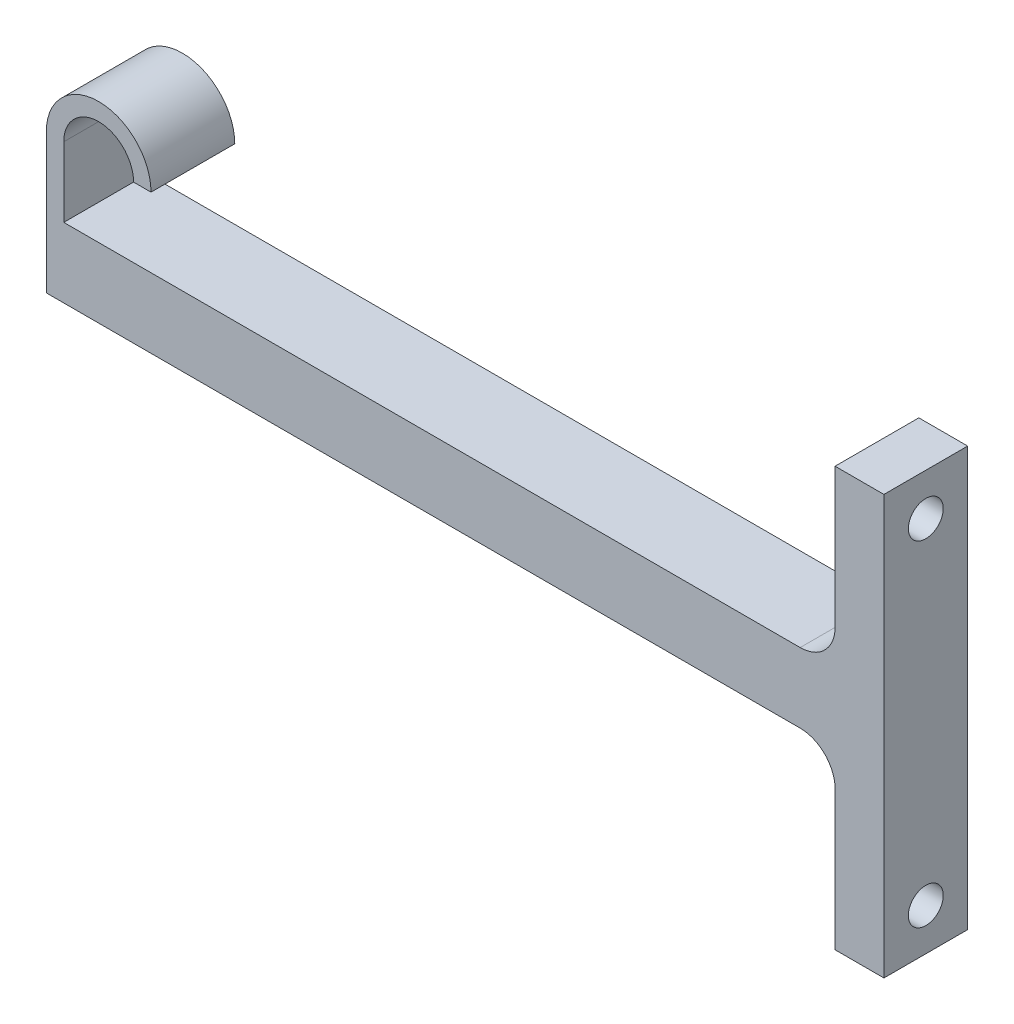
ISO-10303-21;
HEADER;
FILE_DESCRIPTION(('STEP AP214'),'2;1');
FILE_NAME('part.step','',(''),(''),'','','');
FILE_SCHEMA(('AUTOMOTIVE_DESIGN { 1 0 10303 214 1 1 1 1 }'));
ENDSEC;
DATA;
#1=APPLICATION_CONTEXT('core data for automotive mechanical design processes');
#2=APPLICATION_PROTOCOL_DEFINITION('international standard','automotive_design',2000,#1);
#3=PRODUCT_CONTEXT('',#1,'mechanical');
#4=PRODUCT('Part','Part','',(#3));
#5=PRODUCT_RELATED_PRODUCT_CATEGORY('part','',(#4));
#6=PRODUCT_DEFINITION_FORMATION('','',#4);
#7=PRODUCT_DEFINITION_CONTEXT('part definition',#1,'design');
#8=PRODUCT_DEFINITION('design','',#6,#7);
#9=PRODUCT_DEFINITION_SHAPE('','',#8);
#10=(LENGTH_UNIT() NAMED_UNIT(*) SI_UNIT(.MILLI.,.METRE.));
#11=(NAMED_UNIT(*) PLANE_ANGLE_UNIT() SI_UNIT($,.RADIAN.));
#12=(NAMED_UNIT(*) SI_UNIT($,.STERADIAN.) SOLID_ANGLE_UNIT());
#13=UNCERTAINTY_MEASURE_WITH_UNIT(LENGTH_MEASURE(1.E-05),#10,'distance_accuracy_value','');
#14=(GEOMETRIC_REPRESENTATION_CONTEXT(3) GLOBAL_UNCERTAINTY_ASSIGNED_CONTEXT((#13)) GLOBAL_UNIT_ASSIGNED_CONTEXT((#10,
#11,#12)) REPRESENTATION_CONTEXT('',''));
#15=CARTESIAN_POINT('',(0.,0.,0.));
#16=DIRECTION('',(0.,0.,1.));
#17=DIRECTION('',(1.,0.,0.));
#18=AXIS2_PLACEMENT_3D('',#15,#16,#17);
#19=CARTESIAN_POINT('',(7.5,20.,12.));
#20=DIRECTION('',(0.,0.,-1.));
#21=DIRECTION('',(-1.,0.,0.));
#22=AXIS2_PLACEMENT_3D('',#19,#20,#21);
#23=CYLINDRICAL_SURFACE('',#22,7.5);
#24=CARTESIAN_POINT('',(7.5,20.,0.));
#25=DIRECTION('',(0.,0.,1.));
#26=DIRECTION('',(1.,0.,0.));
#27=AXIS2_PLACEMENT_3D('',#24,#25,#26);
#28=CIRCLE('',#27,7.5);
#29=CARTESIAN_POINT('',(15.,20.,0.));
#30=VERTEX_POINT('',#29);
#31=CARTESIAN_POINT('',(0.,20.,0.));
#32=VERTEX_POINT('',#31);
#33=EDGE_CURVE('E166',#30,#32,#28,.T.);
#34=ORIENTED_EDGE('',*,*,#33,.T.);
#35=DIRECTION('',(0.,0.,-1.));
#36=VECTOR('',#35,1.);
#37=CARTESIAN_POINT('',(0.,20.,12.));
#38=LINE('',#37,#36);
#39=CARTESIAN_POINT('',(0.,20.,12.));
#40=VERTEX_POINT('',#39);
#41=EDGE_CURVE('E225',#40,#32,#38,.T.);
#42=ORIENTED_EDGE('',*,*,#41,.F.);
#43=CARTESIAN_POINT('',(7.5,20.,12.));
#44=DIRECTION('',(0.,0.,1.));
#45=DIRECTION('',(1.,0.,0.));
#46=AXIS2_PLACEMENT_3D('',#43,#44,#45);
#47=CIRCLE('',#46,7.5);
#48=CARTESIAN_POINT('',(15.,20.,12.));
#49=VERTEX_POINT('',#48);
#50=EDGE_CURVE('E194',#49,#40,#47,.T.);
#51=ORIENTED_EDGE('',*,*,#50,.F.);
#52=DIRECTION('',(0.,0.,-1.));
#53=VECTOR('',#52,1.);
#54=CARTESIAN_POINT('',(15.,20.,12.));
#55=LINE('',#54,#53);
#56=EDGE_CURVE('E162',#49,#30,#55,.T.);
#57=ORIENTED_EDGE('',*,*,#56,.T.);
#58=EDGE_LOOP('',(#34,#42,#51,#57));
#59=FACE_BOUND('',#58,.T.);
#60=ADVANCED_FACE('F32',(#59),#23,.T.);
#61=CARTESIAN_POINT('',(0.,0.,12.));
#62=DIRECTION('',(1.,0.,0.));
#63=DIRECTION('',(0.,0.,-1.));
#64=AXIS2_PLACEMENT_3D('',#61,#62,#63);
#65=PLANE('',#64);
#66=DIRECTION('',(0.,-1.,0.));
#67=VECTOR('',#66,1.);
#68=CARTESIAN_POINT('',(0.,0.,0.));
#69=LINE('',#68,#67);
#70=CARTESIAN_POINT('',(0.,0.,0.));
#71=VERTEX_POINT('',#70);
#72=EDGE_CURVE('E169',#32,#71,#69,.T.);
#73=ORIENTED_EDGE('',*,*,#72,.T.);
#74=DIRECTION('',(0.,0.,-1.));
#75=VECTOR('',#74,1.);
#76=CARTESIAN_POINT('',(0.,0.,12.));
#77=LINE('',#76,#75);
#78=CARTESIAN_POINT('',(0.,0.,12.));
#79=VERTEX_POINT('',#78);
#80=EDGE_CURVE('E222',#79,#71,#77,.T.);
#81=ORIENTED_EDGE('',*,*,#80,.F.);
#82=DIRECTION('',(0.,-1.,0.));
#83=VECTOR('',#82,1.);
#84=CARTESIAN_POINT('',(0.,0.,12.));
#85=LINE('',#84,#83);
#86=EDGE_CURVE('E111',#40,#79,#85,.T.);
#87=ORIENTED_EDGE('',*,*,#86,.F.);
#88=ORIENTED_EDGE('',*,*,#41,.T.);
#89=EDGE_LOOP('',(#73,#81,#87,#88));
#90=FACE_BOUND('',#89,.T.);
#91=ADVANCED_FACE('F248',(#90),#65,.F.);
#92=CARTESIAN_POINT('',(0.,0.,12.));
#93=DIRECTION('',(0.,1.,0.));
#94=DIRECTION('',(0.,0.,1.));
#95=AXIS2_PLACEMENT_3D('',#92,#93,#94);
#96=PLANE('',#95);
#97=DIRECTION('',(1.,0.,0.));
#98=VECTOR('',#97,1.);
#99=CARTESIAN_POINT('',(0.,0.,0.));
#100=LINE('',#99,#98);
#101=CARTESIAN_POINT('',(108.,0.,0.));
#102=VERTEX_POINT('',#101);
#103=EDGE_CURVE('E172',#71,#102,#100,.T.);
#104=ORIENTED_EDGE('',*,*,#103,.T.);
#105=DIRECTION('',(0.,0.,-1.));
#106=VECTOR('',#105,1.);
#107=CARTESIAN_POINT('',(108.,0.,12.));
#108=LINE('',#107,#106);
#109=CARTESIAN_POINT('',(108.,0.,12.));
#110=VERTEX_POINT('',#109);
#111=EDGE_CURVE('E219',#110,#102,#108,.T.);
#112=ORIENTED_EDGE('',*,*,#111,.F.);
#113=DIRECTION('',(1.,0.,0.));
#114=VECTOR('',#113,1.);
#115=CARTESIAN_POINT('',(0.,0.,12.));
#116=LINE('',#115,#114);
#117=EDGE_CURVE('E322',#79,#110,#116,.T.);
#118=ORIENTED_EDGE('',*,*,#117,.F.);
#119=ORIENTED_EDGE('',*,*,#80,.T.);
#120=EDGE_LOOP('',(#104,#112,#118,#119));
#121=FACE_BOUND('',#120,.T.);
#122=ADVANCED_FACE('F254',(#121),#96,.F.);
#123=CARTESIAN_POINT('',(108.,-5.,12.));
#124=DIRECTION('',(0.,0.,-1.));
#125=DIRECTION('',(-1.,0.,0.));
#126=AXIS2_PLACEMENT_3D('',#123,#124,#125);
#127=CYLINDRICAL_SURFACE('',#126,5.);
#128=CARTESIAN_POINT('',(108.,-5.,0.));
#129=DIRECTION('',(0.,0.,-1.));
#130=DIRECTION('',(1.,0.,0.));
#131=AXIS2_PLACEMENT_3D('',#128,#129,#130);
#132=CIRCLE('',#131,5.);
#133=CARTESIAN_POINT('',(113.,-5.,0.));
#134=VERTEX_POINT('',#133);
#135=EDGE_CURVE('E174',#102,#134,#132,.T.);
#136=ORIENTED_EDGE('',*,*,#135,.T.);
#137=DIRECTION('',(0.,0.,-1.));
#138=VECTOR('',#137,1.);
#139=CARTESIAN_POINT('',(113.,-5.,12.));
#140=LINE('',#139,#138);
#141=CARTESIAN_POINT('',(113.,-5.,12.));
#142=VERTEX_POINT('',#141);
#143=EDGE_CURVE('E216',#142,#134,#140,.T.);
#144=ORIENTED_EDGE('',*,*,#143,.F.);
#145=CARTESIAN_POINT('',(108.,-5.,12.));
#146=DIRECTION('',(0.,0.,-1.));
#147=DIRECTION('',(1.,0.,0.));
#148=AXIS2_PLACEMENT_3D('',#145,#146,#147);
#149=CIRCLE('',#148,5.);
#150=EDGE_CURVE('E324',#110,#142,#149,.T.);
#151=ORIENTED_EDGE('',*,*,#150,.F.);
#152=ORIENTED_EDGE('',*,*,#111,.T.);
#153=EDGE_LOOP('',(#136,#144,#151,#152));
#154=FACE_BOUND('',#153,.T.);
#155=ADVANCED_FACE('F259',(#154),#127,.F.);
#156=CARTESIAN_POINT('',(113.,-25.,12.));
#157=DIRECTION('',(1.,0.,0.));
#158=DIRECTION('',(0.,0.,-1.));
#159=AXIS2_PLACEMENT_3D('',#156,#157,#158);
#160=PLANE('',#159);
#161=CARTESIAN_POINT('',(113.,-19.,6.));
#162=DIRECTION('',(1.,0.,0.));
#163=DIRECTION('',(0.,0.,-1.));
#164=AXIS2_PLACEMENT_3D('',#161,#162,#163);
#165=CIRCLE('',#164,5.);
#166=CARTESIAN_POINT('',(113.,-19.,0.999999999999996));
#167=VERTEX_POINT('',#166);
#168=EDGE_CURVE('E230',#167,#167,#165,.T.);
#169=ORIENTED_EDGE('',*,*,#168,.T.);
#170=EDGE_LOOP('',(#169));
#171=FACE_BOUND('',#170,.T.);
#172=DIRECTION('',(0.,-1.,0.));
#173=VECTOR('',#172,1.);
#174=CARTESIAN_POINT('',(113.,-25.,0.));
#175=LINE('',#174,#173);
#176=CARTESIAN_POINT('',(113.,-25.,0.));
#177=VERTEX_POINT('',#176);
#178=EDGE_CURVE('E176',#134,#177,#175,.T.);
#179=ORIENTED_EDGE('',*,*,#178,.T.);
#180=DIRECTION('',(0.,0.,-1.));
#181=VECTOR('',#180,1.);
#182=CARTESIAN_POINT('',(113.,-25.,12.));
#183=LINE('',#182,#181);
#184=CARTESIAN_POINT('',(113.,-25.,12.));
#185=VERTEX_POINT('',#184);
#186=EDGE_CURVE('E213',#185,#177,#183,.T.);
#187=ORIENTED_EDGE('',*,*,#186,.F.);
#188=DIRECTION('',(0.,-1.,0.));
#189=VECTOR('',#188,1.);
#190=CARTESIAN_POINT('',(113.,-25.,12.));
#191=LINE('',#190,#189);
#192=EDGE_CURVE('E326',#142,#185,#191,.T.);
#193=ORIENTED_EDGE('',*,*,#192,.F.);
#194=ORIENTED_EDGE('',*,*,#143,.T.);
#195=EDGE_LOOP('',(#179,#187,#193,#194));
#196=FACE_BOUND('',#195,.T.);
#197=ADVANCED_FACE('F263',(#171,#196),#160,.F.);
#198=CARTESIAN_POINT('',(120.,-25.,12.));
#199=DIRECTION('',(0.,1.,0.));
#200=DIRECTION('',(0.,0.,1.));
#201=AXIS2_PLACEMENT_3D('',#198,#199,#200);
#202=PLANE('',#201);
#203=DIRECTION('',(1.,0.,0.));
#204=VECTOR('',#203,1.);
#205=CARTESIAN_POINT('',(120.,-25.,0.));
#206=LINE('',#205,#204);
#207=CARTESIAN_POINT('',(120.,-25.,0.));
#208=VERTEX_POINT('',#207);
#209=EDGE_CURVE('E178',#177,#208,#206,.T.);
#210=ORIENTED_EDGE('',*,*,#209,.T.);
#211=DIRECTION('',(0.,0.,-1.));
#212=VECTOR('',#211,1.);
#213=CARTESIAN_POINT('',(120.,-25.,12.));
#214=LINE('',#213,#212);
#215=CARTESIAN_POINT('',(120.,-25.,12.));
#216=VERTEX_POINT('',#215);
#217=EDGE_CURVE('E210',#216,#208,#214,.T.);
#218=ORIENTED_EDGE('',*,*,#217,.F.);
#219=DIRECTION('',(1.,0.,0.));
#220=VECTOR('',#219,1.);
#221=CARTESIAN_POINT('',(120.,-25.,12.));
#222=LINE('',#221,#220);
#223=EDGE_CURVE('E328',#185,#216,#222,.T.);
#224=ORIENTED_EDGE('',*,*,#223,.F.);
#225=ORIENTED_EDGE('',*,*,#186,.T.);
#226=EDGE_LOOP('',(#210,#218,#224,#225));
#227=FACE_BOUND('',#226,.T.);
#228=ADVANCED_FACE('F267',(#227),#202,.F.);
#229=CARTESIAN_POINT('',(120.,35.,12.));
#230=DIRECTION('',(-1.,0.,0.));
#231=DIRECTION('',(0.,0.,1.));
#232=AXIS2_PLACEMENT_3D('',#229,#230,#231);
#233=PLANE('',#232);
#234=CARTESIAN_POINT('',(120.,-19.,6.));
#235=DIRECTION('',(1.,0.,0.));
#236=DIRECTION('',(0.,0.,-1.));
#237=AXIS2_PLACEMENT_3D('',#234,#235,#236);
#238=CIRCLE('',#237,2.5);
#239=CARTESIAN_POINT('',(120.,-19.,3.5));
#240=VERTEX_POINT('',#239);
#241=EDGE_CURVE('E315',#240,#240,#238,.T.);
#242=ORIENTED_EDGE('',*,*,#241,.F.);
#243=EDGE_LOOP('',(#242));
#244=FACE_BOUND('',#243,.T.);
#245=CARTESIAN_POINT('',(120.,29.,6.));
#246=DIRECTION('',(1.,0.,0.));
#247=DIRECTION('',(0.,0.,-1.));
#248=AXIS2_PLACEMENT_3D('',#245,#246,#247);
#249=CIRCLE('',#248,2.5);
#250=CARTESIAN_POINT('',(120.,29.,3.5));
#251=VERTEX_POINT('',#250);
#252=EDGE_CURVE('E170',#251,#251,#249,.T.);
#253=ORIENTED_EDGE('',*,*,#252,.F.);
#254=EDGE_LOOP('',(#253));
#255=FACE_BOUND('',#254,.T.);
#256=DIRECTION('',(0.,1.,0.));
#257=VECTOR('',#256,1.);
#258=CARTESIAN_POINT('',(120.,35.,0.));
#259=LINE('',#258,#257);
#260=CARTESIAN_POINT('',(120.,35.,0.));
#261=VERTEX_POINT('',#260);
#262=EDGE_CURVE('E181',#208,#261,#259,.T.);
#263=ORIENTED_EDGE('',*,*,#262,.T.);
#264=DIRECTION('',(0.,0.,-1.));
#265=VECTOR('',#264,1.);
#266=CARTESIAN_POINT('',(120.,35.,12.));
#267=LINE('',#266,#265);
#268=CARTESIAN_POINT('',(120.,35.,12.));
#269=VERTEX_POINT('',#268);
#270=EDGE_CURVE('E207',#269,#261,#267,.T.);
#271=ORIENTED_EDGE('',*,*,#270,.F.);
#272=DIRECTION('',(0.,1.,0.));
#273=VECTOR('',#272,1.);
#274=CARTESIAN_POINT('',(120.,5.,12.));
#275=LINE('',#274,#273);
#276=EDGE_CURVE('E330',#216,#269,#275,.T.);
#277=ORIENTED_EDGE('',*,*,#276,.F.);
#278=ORIENTED_EDGE('',*,*,#217,.T.);
#279=EDGE_LOOP('',(#263,#271,#277,#278));
#280=FACE_BOUND('',#279,.T.);
#281=ADVANCED_FACE('F271',(#244,#255,#280),#233,.F.);
#282=CARTESIAN_POINT('',(113.,35.,12.));
#283=DIRECTION('',(0.,-1.,0.));
#284=DIRECTION('',(1.,0.,0.));
#285=AXIS2_PLACEMENT_3D('',#282,#283,#284);
#286=PLANE('',#285);
#287=DIRECTION('',(-1.,0.,0.));
#288=VECTOR('',#287,1.);
#289=CARTESIAN_POINT('',(113.,35.,0.));
#290=LINE('',#289,#288);
#291=CARTESIAN_POINT('',(113.,35.,0.));
#292=VERTEX_POINT('',#291);
#293=EDGE_CURVE('E183',#261,#292,#290,.T.);
#294=ORIENTED_EDGE('',*,*,#293,.T.);
#295=DIRECTION('',(0.,0.,-1.));
#296=VECTOR('',#295,1.);
#297=CARTESIAN_POINT('',(113.,35.,12.));
#298=LINE('',#297,#296);
#299=CARTESIAN_POINT('',(113.,35.,12.));
#300=VERTEX_POINT('',#299);
#301=EDGE_CURVE('E204',#300,#292,#298,.T.);
#302=ORIENTED_EDGE('',*,*,#301,.F.);
#303=DIRECTION('',(-1.,0.,0.));
#304=VECTOR('',#303,1.);
#305=CARTESIAN_POINT('',(113.,35.,12.));
#306=LINE('',#305,#304);
#307=EDGE_CURVE('E332',#269,#300,#306,.T.);
#308=ORIENTED_EDGE('',*,*,#307,.F.);
#309=ORIENTED_EDGE('',*,*,#270,.T.);
#310=EDGE_LOOP('',(#294,#302,#308,#309));
#311=FACE_BOUND('',#310,.T.);
#312=ADVANCED_FACE('F275',(#311),#286,.F.);
#313=CARTESIAN_POINT('',(113.,15.,12.));
#314=DIRECTION('',(1.,0.,0.));
#315=DIRECTION('',(0.,1.,0.));
#316=AXIS2_PLACEMENT_3D('',#313,#314,#315);
#317=PLANE('',#316);
#318=CARTESIAN_POINT('',(113.,29.,6.));
#319=DIRECTION('',(1.,0.,0.));
#320=DIRECTION('',(0.,1.,0.));
#321=AXIS2_PLACEMENT_3D('',#318,#319,#320);
#322=CIRCLE('',#321,5.);
#323=CARTESIAN_POINT('',(113.,34.,6.));
#324=VERTEX_POINT('',#323);
#325=EDGE_CURVE('E11',#324,#324,#322,.T.);
#326=ORIENTED_EDGE('',*,*,#325,.T.);
#327=EDGE_LOOP('',(#326));
#328=FACE_BOUND('',#327,.T.);
#329=DIRECTION('',(0.,-1.,0.));
#330=VECTOR('',#329,1.);
#331=CARTESIAN_POINT('',(113.,15.,0.));
#332=LINE('',#331,#330);
#333=CARTESIAN_POINT('',(113.,15.,0.));
#334=VERTEX_POINT('',#333);
#335=EDGE_CURVE('E185',#292,#334,#332,.T.);
#336=ORIENTED_EDGE('',*,*,#335,.T.);
#337=DIRECTION('',(0.,0.,-1.));
#338=VECTOR('',#337,1.);
#339=CARTESIAN_POINT('',(113.,15.,12.));
#340=LINE('',#339,#338);
#341=CARTESIAN_POINT('',(113.,15.,12.));
#342=VERTEX_POINT('',#341);
#343=EDGE_CURVE('E201',#342,#334,#340,.T.);
#344=ORIENTED_EDGE('',*,*,#343,.F.);
#345=DIRECTION('',(0.,-1.,0.));
#346=VECTOR('',#345,1.);
#347=CARTESIAN_POINT('',(113.,15.,12.));
#348=LINE('',#347,#346);
#349=EDGE_CURVE('E334',#300,#342,#348,.T.);
#350=ORIENTED_EDGE('',*,*,#349,.F.);
#351=ORIENTED_EDGE('',*,*,#301,.T.);
#352=EDGE_LOOP('',(#336,#344,#350,#351));
#353=FACE_BOUND('',#352,.T.);
#354=ADVANCED_FACE('F279',(#328,#353),#317,.F.);
#355=CARTESIAN_POINT('',(108.,15.,12.));
#356=DIRECTION('',(0.,0.,-1.));
#357=DIRECTION('',(-1.,0.,0.));
#358=AXIS2_PLACEMENT_3D('',#355,#356,#357);
#359=CYLINDRICAL_SURFACE('',#358,5.);
#360=CARTESIAN_POINT('',(108.,15.,0.));
#361=DIRECTION('',(0.,0.,-1.));
#362=DIRECTION('',(-1.,0.,0.));
#363=AXIS2_PLACEMENT_3D('',#360,#361,#362);
#364=CIRCLE('',#363,5.);
#365=CARTESIAN_POINT('',(108.,10.,0.));
#366=VERTEX_POINT('',#365);
#367=EDGE_CURVE('E187',#334,#366,#364,.T.);
#368=ORIENTED_EDGE('',*,*,#367,.T.);
#369=DIRECTION('',(0.,0.,-1.));
#370=VECTOR('',#369,1.);
#371=CARTESIAN_POINT('',(108.,10.,12.));
#372=LINE('',#371,#370);
#373=CARTESIAN_POINT('',(108.,10.,12.));
#374=VERTEX_POINT('',#373);
#375=EDGE_CURVE('E198',#374,#366,#372,.T.);
#376=ORIENTED_EDGE('',*,*,#375,.F.);
#377=CARTESIAN_POINT('',(108.,15.,12.));
#378=DIRECTION('',(0.,0.,-1.));
#379=DIRECTION('',(-1.,0.,0.));
#380=AXIS2_PLACEMENT_3D('',#377,#378,#379);
#381=CIRCLE('',#380,5.);
#382=EDGE_CURVE('E336',#342,#374,#381,.T.);
#383=ORIENTED_EDGE('',*,*,#382,.F.);
#384=ORIENTED_EDGE('',*,*,#343,.T.);
#385=EDGE_LOOP('',(#368,#376,#383,#384));
#386=FACE_BOUND('',#385,.T.);
#387=ADVANCED_FACE('F283',(#386),#359,.F.);
#388=CARTESIAN_POINT('',(2.5,10.,12.));
#389=DIRECTION('',(0.,-1.,0.));
#390=DIRECTION('',(1.,0.,0.));
#391=AXIS2_PLACEMENT_3D('',#388,#389,#390);
#392=PLANE('',#391);
#393=DIRECTION('',(-1.,0.,0.));
#394=VECTOR('',#393,1.);
#395=CARTESIAN_POINT('',(2.5,10.,0.));
#396=LINE('',#395,#394);
#397=CARTESIAN_POINT('',(2.5,10.,0.));
#398=VERTEX_POINT('',#397);
#399=EDGE_CURVE('E189',#366,#398,#396,.T.);
#400=ORIENTED_EDGE('',*,*,#399,.T.);
#401=DIRECTION('',(0.,0.,-1.));
#402=VECTOR('',#401,1.);
#403=CARTESIAN_POINT('',(2.5,10.,12.));
#404=LINE('',#403,#402);
#405=CARTESIAN_POINT('',(2.5,10.,12.));
#406=VERTEX_POINT('',#405);
#407=EDGE_CURVE('E157',#406,#398,#404,.T.);
#408=ORIENTED_EDGE('',*,*,#407,.F.);
#409=DIRECTION('',(-1.,0.,0.));
#410=VECTOR('',#409,1.);
#411=CARTESIAN_POINT('',(2.5,10.,12.));
#412=LINE('',#411,#410);
#413=EDGE_CURVE('E148',#374,#406,#412,.T.);
#414=ORIENTED_EDGE('',*,*,#413,.F.);
#415=ORIENTED_EDGE('',*,*,#375,.T.);
#416=EDGE_LOOP('',(#400,#408,#414,#415));
#417=FACE_BOUND('',#416,.T.);
#418=ADVANCED_FACE('F287',(#417),#392,.F.);
#419=CARTESIAN_POINT('',(2.5,20.,12.));
#420=DIRECTION('',(-1.,0.,0.));
#421=DIRECTION('',(0.,-1.,0.));
#422=AXIS2_PLACEMENT_3D('',#419,#420,#421);
#423=PLANE('',#422);
#424=DIRECTION('',(0.,1.,0.));
#425=VECTOR('',#424,1.);
#426=CARTESIAN_POINT('',(2.5,20.,0.));
#427=LINE('',#426,#425);
#428=CARTESIAN_POINT('',(2.5,20.,0.));
#429=VERTEX_POINT('',#428);
#430=EDGE_CURVE('E156',#398,#429,#427,.T.);
#431=ORIENTED_EDGE('',*,*,#430,.T.);
#432=DIRECTION('',(0.,0.,-1.));
#433=VECTOR('',#432,1.);
#434=CARTESIAN_POINT('',(2.5,20.,12.));
#435=LINE('',#434,#433);
#436=CARTESIAN_POINT('',(2.5,20.,12.));
#437=VERTEX_POINT('',#436);
#438=EDGE_CURVE('E153',#437,#429,#435,.T.);
#439=ORIENTED_EDGE('',*,*,#438,.F.);
#440=DIRECTION('',(0.,1.,0.));
#441=VECTOR('',#440,1.);
#442=CARTESIAN_POINT('',(2.5,20.,12.));
#443=LINE('',#442,#441);
#444=EDGE_CURVE('E142',#406,#437,#443,.T.);
#445=ORIENTED_EDGE('',*,*,#444,.F.);
#446=ORIENTED_EDGE('',*,*,#407,.T.);
#447=EDGE_LOOP('',(#431,#439,#445,#446));
#448=FACE_BOUND('',#447,.T.);
#449=ADVANCED_FACE('F154',(#448),#423,.F.);
#450=CARTESIAN_POINT('',(7.5,20.,12.));
#451=DIRECTION('',(0.,0.,-1.));
#452=DIRECTION('',(-1.,0.,0.));
#453=AXIS2_PLACEMENT_3D('',#450,#451,#452);
#454=CYLINDRICAL_SURFACE('',#453,5.);
#455=CARTESIAN_POINT('',(7.5,20.,0.));
#456=DIRECTION('',(0.,0.,-1.));
#457=DIRECTION('',(-1.,0.,0.));
#458=AXIS2_PLACEMENT_3D('',#455,#456,#457);
#459=CIRCLE('',#458,5.);
#460=CARTESIAN_POINT('',(12.5,20.,0.));
#461=VERTEX_POINT('',#460);
#462=EDGE_CURVE('E96',#429,#461,#459,.T.);
#463=ORIENTED_EDGE('',*,*,#462,.T.);
#464=DIRECTION('',(0.,0.,-1.));
#465=VECTOR('',#464,1.);
#466=CARTESIAN_POINT('',(12.5,20.,12.));
#467=LINE('',#466,#465);
#468=CARTESIAN_POINT('',(12.5,20.,12.));
#469=VERTEX_POINT('',#468);
#470=EDGE_CURVE('E158',#469,#461,#467,.T.);
#471=ORIENTED_EDGE('',*,*,#470,.F.);
#472=CARTESIAN_POINT('',(7.5,20.,12.));
#473=DIRECTION('',(0.,0.,-1.));
#474=DIRECTION('',(-1.,0.,0.));
#475=AXIS2_PLACEMENT_3D('',#472,#473,#474);
#476=CIRCLE('',#475,5.);
#477=EDGE_CURVE('E146',#437,#469,#476,.T.);
#478=ORIENTED_EDGE('',*,*,#477,.F.);
#479=ORIENTED_EDGE('',*,*,#438,.T.);
#480=EDGE_LOOP('',(#463,#471,#478,#479));
#481=FACE_BOUND('',#480,.T.);
#482=ADVANCED_FACE('F160',(#481),#454,.F.);
#483=CARTESIAN_POINT('',(12.5,20.,12.));
#484=DIRECTION('',(0.,1.,0.));
#485=DIRECTION('',(0.,0.,1.));
#486=AXIS2_PLACEMENT_3D('',#483,#484,#485);
#487=PLANE('',#486);
#488=DIRECTION('',(1.,0.,0.));
#489=VECTOR('',#488,1.);
#490=CARTESIAN_POINT('',(12.5,20.,0.));
#491=LINE('',#490,#489);
#492=EDGE_CURVE('E102',#461,#30,#491,.T.);
#493=ORIENTED_EDGE('',*,*,#492,.T.);
#494=ORIENTED_EDGE('',*,*,#56,.F.);
#495=DIRECTION('',(1.,0.,0.));
#496=VECTOR('',#495,1.);
#497=CARTESIAN_POINT('',(12.5,20.,12.));
#498=LINE('',#497,#496);
#499=EDGE_CURVE('E49',#469,#49,#498,.T.);
#500=ORIENTED_EDGE('',*,*,#499,.F.);
#501=ORIENTED_EDGE('',*,*,#470,.T.);
#502=EDGE_LOOP('',(#493,#494,#500,#501));
#503=FACE_BOUND('',#502,.T.);
#504=ADVANCED_FACE('F296',(#503),#487,.F.);
#505=CARTESIAN_POINT('',(7.5,20.,12.));
#506=DIRECTION('',(0.,0.,1.));
#507=DIRECTION('',(1.,0.,0.));
#508=AXIS2_PLACEMENT_3D('',#505,#506,#507);
#509=PLANE('',#508);
#510=ORIENTED_EDGE('',*,*,#50,.T.);
#511=ORIENTED_EDGE('',*,*,#86,.T.);
#512=ORIENTED_EDGE('',*,*,#117,.T.);
#513=ORIENTED_EDGE('',*,*,#150,.T.);
#514=ORIENTED_EDGE('',*,*,#192,.T.);
#515=ORIENTED_EDGE('',*,*,#223,.T.);
#516=ORIENTED_EDGE('',*,*,#276,.T.);
#517=ORIENTED_EDGE('',*,*,#307,.T.);
#518=ORIENTED_EDGE('',*,*,#349,.T.);
#519=ORIENTED_EDGE('',*,*,#382,.T.);
#520=ORIENTED_EDGE('',*,*,#413,.T.);
#521=ORIENTED_EDGE('',*,*,#444,.T.);
#522=ORIENTED_EDGE('',*,*,#477,.T.);
#523=ORIENTED_EDGE('',*,*,#499,.T.);
#524=EDGE_LOOP('',(#510,#511,#512,#513,#514,#515,#516,#517,#518,#519,#520,#521,#522,#523));
#525=FACE_BOUND('',#524,.T.);
#526=ADVANCED_FACE('F144',(#525),#509,.T.);
#527=CARTESIAN_POINT('',(7.5,20.,0.));
#528=DIRECTION('',(0.,0.,1.));
#529=DIRECTION('',(1.,0.,0.));
#530=AXIS2_PLACEMENT_3D('',#527,#528,#529);
#531=PLANE('',#530);
#532=ORIENTED_EDGE('',*,*,#33,.F.);
#533=ORIENTED_EDGE('',*,*,#492,.F.);
#534=ORIENTED_EDGE('',*,*,#462,.F.);
#535=ORIENTED_EDGE('',*,*,#430,.F.);
#536=ORIENTED_EDGE('',*,*,#399,.F.);
#537=ORIENTED_EDGE('',*,*,#367,.F.);
#538=ORIENTED_EDGE('',*,*,#335,.F.);
#539=ORIENTED_EDGE('',*,*,#293,.F.);
#540=ORIENTED_EDGE('',*,*,#262,.F.);
#541=ORIENTED_EDGE('',*,*,#209,.F.);
#542=ORIENTED_EDGE('',*,*,#178,.F.);
#543=ORIENTED_EDGE('',*,*,#135,.F.);
#544=ORIENTED_EDGE('',*,*,#103,.F.);
#545=ORIENTED_EDGE('',*,*,#72,.F.);
#546=EDGE_LOOP('',(#532,#533,#534,#535,#536,#537,#538,#539,#540,#541,#542,#543,#544,#545));
#547=FACE_BOUND('',#546,.T.);
#548=ADVANCED_FACE('F299',(#547),#531,.F.);
#549=CARTESIAN_POINT('',(-0.001000000000001,29.,6.));
#550=DIRECTION('',(1.,0.,0.));
#551=DIRECTION('',(0.,0.,-1.));
#552=AXIS2_PLACEMENT_3D('',#549,#550,#551);
#553=CYLINDRICAL_SURFACE('',#552,2.5);
#554=CARTESIAN_POINT('',(115.5,29.,6.));
#555=DIRECTION('',(1.,0.,0.));
#556=DIRECTION('',(0.,0.,-1.));
#557=AXIS2_PLACEMENT_3D('',#554,#555,#556);
#558=CIRCLE('',#557,2.5);
#559=CARTESIAN_POINT('',(115.5,29.,3.5));
#560=VERTEX_POINT('',#559);
#561=EDGE_CURVE('E41',#560,#560,#558,.F.);
#562=ORIENTED_EDGE('',*,*,#561,.T.);
#563=EDGE_LOOP('',(#562));
#564=FACE_BOUND('',#563,.T.);
#565=ORIENTED_EDGE('',*,*,#252,.T.);
#566=EDGE_LOOP('',(#565));
#567=FACE_BOUND('',#566,.T.);
#568=ADVANCED_FACE('F235',(#564,#567),#553,.F.);
#569=CARTESIAN_POINT('',(-0.001000000000001,-19.,6.));
#570=DIRECTION('',(1.,0.,0.));
#571=DIRECTION('',(0.,0.,-1.));
#572=AXIS2_PLACEMENT_3D('',#569,#570,#571);
#573=CYLINDRICAL_SURFACE('',#572,2.5);
#574=CARTESIAN_POINT('',(115.5,-19.,6.));
#575=DIRECTION('',(1.,0.,0.));
#576=DIRECTION('',(0.,0.,-1.));
#577=AXIS2_PLACEMENT_3D('',#574,#575,#576);
#578=CIRCLE('',#577,2.5);
#579=CARTESIAN_POINT('',(115.5,-19.,3.5));
#580=VERTEX_POINT('',#579);
#581=EDGE_CURVE('E227',#580,#580,#578,.F.);
#582=ORIENTED_EDGE('',*,*,#581,.T.);
#583=EDGE_LOOP('',(#582));
#584=FACE_BOUND('',#583,.T.);
#585=ORIENTED_EDGE('',*,*,#241,.T.);
#586=EDGE_LOOP('',(#585));
#587=FACE_BOUND('',#586,.T.);
#588=ADVANCED_FACE('F244',(#584,#587),#573,.F.);
#589=CARTESIAN_POINT('',(115.5,-19.,6.));
#590=DIRECTION('',(-1.,0.,0.));
#591=DIRECTION('',(0.,0.,1.));
#592=AXIS2_PLACEMENT_3D('',#589,#590,#591);
#593=CONICAL_SURFACE('',#592,2.5,0.785398163397448);
#594=ORIENTED_EDGE('',*,*,#168,.F.);
#595=EDGE_LOOP('',(#594));
#596=FACE_BOUND('',#595,.T.);
#597=ORIENTED_EDGE('',*,*,#581,.F.);
#598=EDGE_LOOP('',(#597));
#599=FACE_BOUND('',#598,.T.);
#600=ADVANCED_FACE('F239',(#596,#599),#593,.F.);
#601=CARTESIAN_POINT('',(115.5,29.,6.));
#602=DIRECTION('',(-1.,0.,0.));
#603=DIRECTION('',(0.,0.,1.));
#604=AXIS2_PLACEMENT_3D('',#601,#602,#603);
#605=CONICAL_SURFACE('',#604,2.5,0.78539816339745);
#606=ORIENTED_EDGE('',*,*,#325,.F.);
#607=EDGE_LOOP('',(#606));
#608=FACE_BOUND('',#607,.T.);
#609=ORIENTED_EDGE('',*,*,#561,.F.);
#610=EDGE_LOOP('',(#609));
#611=FACE_BOUND('',#610,.T.);
#612=ADVANCED_FACE('F34',(#608,#611),#605,.F.);
#613=CLOSED_SHELL('',(#60,#91,#122,#155,#197,#228,#281,#312,#354,#387,#418,#449,#482,#504,#526,
#548,#568,#588,#600,#612));
#614=MANIFOLD_SOLID_BREP('B2',#613);
#615=ADVANCED_BREP_SHAPE_REPRESENTATION('',(#18,#614),#14);
#616=SHAPE_DEFINITION_REPRESENTATION(#9,#615);
ENDSEC;
END-ISO-10303-21;
